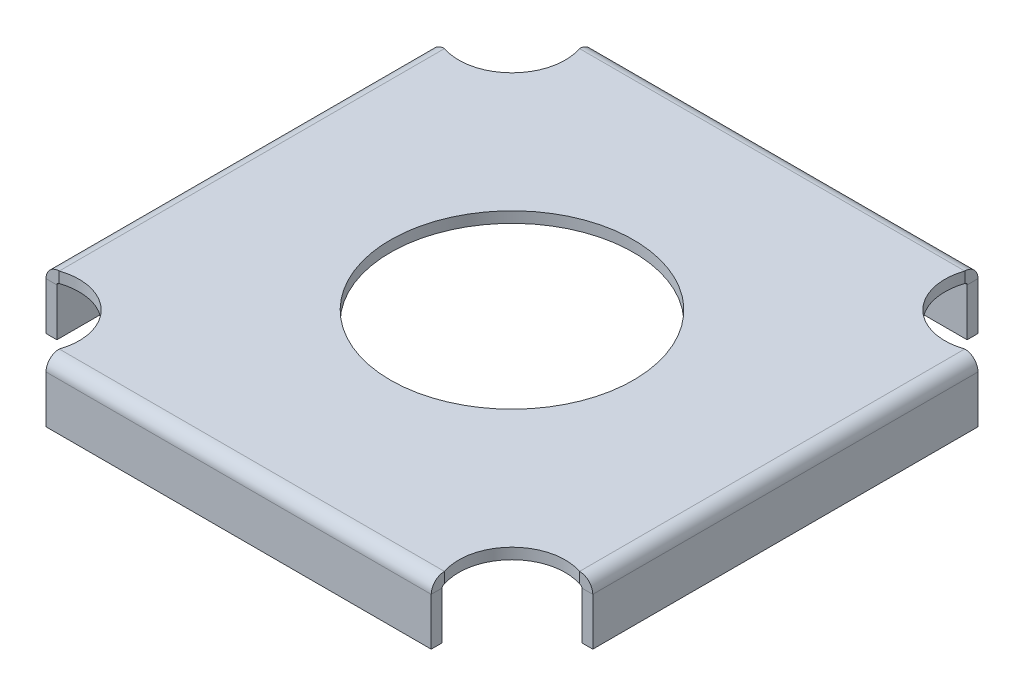
ISO-10303-21;
HEADER;
FILE_DESCRIPTION(('STEP AP214'),'2;1');
FILE_NAME('part.step','',(''),(''),'','','');
FILE_SCHEMA(('AUTOMOTIVE_DESIGN { 1 0 10303 214 1 1 1 1 }'));
ENDSEC;
DATA;
#1=APPLICATION_CONTEXT('core data for automotive mechanical design processes');
#2=APPLICATION_PROTOCOL_DEFINITION('international standard','automotive_design',2000,#1);
#3=PRODUCT_CONTEXT('',#1,'mechanical');
#4=PRODUCT('Part','Part','',(#3));
#5=PRODUCT_RELATED_PRODUCT_CATEGORY('part','',(#4));
#6=PRODUCT_DEFINITION_FORMATION('','',#4);
#7=PRODUCT_DEFINITION_CONTEXT('part definition',#1,'design');
#8=PRODUCT_DEFINITION('design','',#6,#7);
#9=PRODUCT_DEFINITION_SHAPE('','',#8);
#10=(LENGTH_UNIT() NAMED_UNIT(*) SI_UNIT(.MILLI.,.METRE.));
#11=(NAMED_UNIT(*) PLANE_ANGLE_UNIT() SI_UNIT($,.RADIAN.));
#12=(NAMED_UNIT(*) SI_UNIT($,.STERADIAN.) SOLID_ANGLE_UNIT());
#13=UNCERTAINTY_MEASURE_WITH_UNIT(LENGTH_MEASURE(1.E-05),#10,'distance_accuracy_value','');
#14=(GEOMETRIC_REPRESENTATION_CONTEXT(3) GLOBAL_UNCERTAINTY_ASSIGNED_CONTEXT((#13)) GLOBAL_UNIT_ASSIGNED_CONTEXT((#10,
#11,#12)) REPRESENTATION_CONTEXT('',''));
#15=CARTESIAN_POINT('',(0.,0.,0.));
#16=DIRECTION('',(0.,0.,1.));
#17=DIRECTION('',(1.,0.,0.));
#18=AXIS2_PLACEMENT_3D('',#15,#16,#17);
#19=CARTESIAN_POINT('',(76.2,-3.4163,76.2));
#20=DIRECTION('',(0.,1.,0.));
#21=DIRECTION('',(0.,0.,1.));
#22=AXIS2_PLACEMENT_3D('',#19,#20,#21);
#23=CYLINDRICAL_SURFACE('',#22,16.7005);
#24=CARTESIAN_POINT('',(76.2,0.,76.2));
#25=DIRECTION('',(0.,-1.,0.));
#26=DIRECTION('',(0.,0.,1.));
#27=AXIS2_PLACEMENT_3D('',#24,#25,#26);
#28=CIRCLE('',#27,16.7005);
#29=CARTESIAN_POINT('',(60.3828089759907,0.,81.5594));
#30=VERTEX_POINT('',#29);
#31=CARTESIAN_POINT('',(81.5594,0.,60.3828089759907));
#32=VERTEX_POINT('',#31);
#33=EDGE_CURVE('E462',#30,#32,#28,.T.);
#34=ORIENTED_EDGE('',*,*,#33,.F.);
#35=DIRECTION('',(0.,1.,0.));
#36=VECTOR('',#35,1.);
#37=CARTESIAN_POINT('',(60.3828089759907,-3.4163,81.5594));
#38=LINE('',#37,#36);
#39=CARTESIAN_POINT('',(60.3828089759907,-3.41629999999999,81.5594));
#40=VERTEX_POINT('',#39);
#41=EDGE_CURVE('E13',#40,#30,#38,.T.);
#42=ORIENTED_EDGE('',*,*,#41,.F.);
#43=CARTESIAN_POINT('',(76.2,-3.4163,76.2));
#44=DIRECTION('',(0.,-1.,0.));
#45=DIRECTION('',(0.,0.,1.));
#46=AXIS2_PLACEMENT_3D('',#43,#44,#45);
#47=CIRCLE('',#46,16.7005);
#48=CARTESIAN_POINT('',(81.5594,-3.4163,60.3828089759907));
#49=VERTEX_POINT('',#48);
#50=EDGE_CURVE('E465',#40,#49,#47,.T.);
#51=ORIENTED_EDGE('',*,*,#50,.T.);
#52=DIRECTION('',(0.,1.,0.));
#53=VECTOR('',#52,1.);
#54=CARTESIAN_POINT('',(81.5594,-3.4163,60.3828089759907));
#55=LINE('',#54,#53);
#56=EDGE_CURVE('E119',#49,#32,#55,.T.);
#57=ORIENTED_EDGE('',*,*,#56,.T.);
#58=EDGE_LOOP('',(#34,#42,#51,#57));
#59=FACE_BOUND('',#58,.T.);
#60=ADVANCED_FACE('F116',(#59),#23,.F.);
#61=CARTESIAN_POINT('',(-76.2,-3.4163,76.2));
#62=DIRECTION('',(0.,1.,0.));
#63=DIRECTION('',(0.,0.,1.));
#64=AXIS2_PLACEMENT_3D('',#61,#62,#63);
#65=CYLINDRICAL_SURFACE('',#64,16.7005);
#66=CARTESIAN_POINT('',(-76.2,0.,76.2));
#67=DIRECTION('',(0.,-1.,0.));
#68=DIRECTION('',(0.,0.,1.));
#69=AXIS2_PLACEMENT_3D('',#66,#67,#68);
#70=CIRCLE('',#69,16.7005);
#71=CARTESIAN_POINT('',(-81.5594,0.,60.3828089759907));
#72=VERTEX_POINT('',#71);
#73=CARTESIAN_POINT('',(-60.3828089759907,0.,81.5594));
#74=VERTEX_POINT('',#73);
#75=EDGE_CURVE('E503',#72,#74,#70,.T.);
#76=ORIENTED_EDGE('',*,*,#75,.F.);
#77=DIRECTION('',(0.,1.,0.));
#78=VECTOR('',#77,1.);
#79=CARTESIAN_POINT('',(-81.5594,-3.4163,60.3828089759907));
#80=LINE('',#79,#78);
#81=CARTESIAN_POINT('',(-81.5594,-3.4163,60.3828089759907));
#82=VERTEX_POINT('',#81);
#83=EDGE_CURVE('E510',#82,#72,#80,.T.);
#84=ORIENTED_EDGE('',*,*,#83,.F.);
#85=CARTESIAN_POINT('',(-76.2,-3.4163,76.2));
#86=DIRECTION('',(0.,-1.,0.));
#87=DIRECTION('',(0.,0.,1.));
#88=AXIS2_PLACEMENT_3D('',#85,#86,#87);
#89=CIRCLE('',#88,16.7005);
#90=CARTESIAN_POINT('',(-60.3828089759907,-3.41629999999999,81.5594));
#91=VERTEX_POINT('',#90);
#92=EDGE_CURVE('E481',#82,#91,#89,.T.);
#93=ORIENTED_EDGE('',*,*,#92,.T.);
#94=DIRECTION('',(0.,1.,0.));
#95=VECTOR('',#94,1.);
#96=CARTESIAN_POINT('',(-60.3828089759907,-3.4163,81.5594));
#97=LINE('',#96,#95);
#98=EDGE_CURVE('E124',#91,#74,#97,.T.);
#99=ORIENTED_EDGE('',*,*,#98,.T.);
#100=EDGE_LOOP('',(#76,#84,#93,#99));
#101=FACE_BOUND('',#100,.T.);
#102=ADVANCED_FACE('F542',(#101),#65,.F.);
#103=CARTESIAN_POINT('',(-76.2,-3.4163,-76.2));
#104=DIRECTION('',(0.,1.,0.));
#105=DIRECTION('',(0.,0.,1.));
#106=AXIS2_PLACEMENT_3D('',#103,#104,#105);
#107=CYLINDRICAL_SURFACE('',#106,16.7005);
#108=CARTESIAN_POINT('',(-76.2,0.,-76.2));
#109=DIRECTION('',(0.,-1.,0.));
#110=DIRECTION('',(0.,0.,1.));
#111=AXIS2_PLACEMENT_3D('',#108,#109,#110);
#112=CIRCLE('',#111,16.7005);
#113=CARTESIAN_POINT('',(-60.3828089759907,0.,-81.5594));
#114=VERTEX_POINT('',#113);
#115=CARTESIAN_POINT('',(-81.5594,0.,-60.3828089759907));
#116=VERTEX_POINT('',#115);
#117=EDGE_CURVE('E497',#114,#116,#112,.T.);
#118=ORIENTED_EDGE('',*,*,#117,.F.);
#119=DIRECTION('',(0.,1.,0.));
#120=VECTOR('',#119,1.);
#121=CARTESIAN_POINT('',(-60.3828089759907,-3.4163,-81.5594));
#122=LINE('',#121,#120);
#123=CARTESIAN_POINT('',(-60.3828089759907,-3.4163,-81.5594));
#124=VERTEX_POINT('',#123);
#125=EDGE_CURVE('E515',#124,#114,#122,.T.);
#126=ORIENTED_EDGE('',*,*,#125,.F.);
#127=CARTESIAN_POINT('',(-76.2,-3.4163,-76.2));
#128=DIRECTION('',(0.,-1.,0.));
#129=DIRECTION('',(0.,0.,1.));
#130=AXIS2_PLACEMENT_3D('',#127,#128,#129);
#131=CIRCLE('',#130,16.7005);
#132=CARTESIAN_POINT('',(-81.5594,-3.4163,-60.3828089759907));
#133=VERTEX_POINT('',#132);
#134=EDGE_CURVE('E476',#124,#133,#131,.T.);
#135=ORIENTED_EDGE('',*,*,#134,.T.);
#136=DIRECTION('',(0.,1.,0.));
#137=VECTOR('',#136,1.);
#138=CARTESIAN_POINT('',(-81.5594,-3.4163,-60.3828089759907));
#139=LINE('',#138,#137);
#140=EDGE_CURVE('E512',#133,#116,#139,.T.);
#141=ORIENTED_EDGE('',*,*,#140,.T.);
#142=EDGE_LOOP('',(#118,#126,#135,#141));
#143=FACE_BOUND('',#142,.T.);
#144=ADVANCED_FACE('F587',(#143),#107,.F.);
#145=CARTESIAN_POINT('',(76.2,-3.4163,-76.2));
#146=DIRECTION('',(0.,1.,0.));
#147=DIRECTION('',(0.,0.,1.));
#148=AXIS2_PLACEMENT_3D('',#145,#146,#147);
#149=CYLINDRICAL_SURFACE('',#148,16.7005);
#150=CARTESIAN_POINT('',(76.2,0.,-76.2));
#151=DIRECTION('',(0.,-1.,0.));
#152=DIRECTION('',(0.,0.,1.));
#153=AXIS2_PLACEMENT_3D('',#150,#151,#152);
#154=CIRCLE('',#153,16.7005);
#155=CARTESIAN_POINT('',(81.5594,0.,-60.3828089759907));
#156=VERTEX_POINT('',#155);
#157=CARTESIAN_POINT('',(60.3828089759907,0.,-81.5594));
#158=VERTEX_POINT('',#157);
#159=EDGE_CURVE('E491',#156,#158,#154,.T.);
#160=ORIENTED_EDGE('',*,*,#159,.F.);
#161=DIRECTION('',(0.,1.,0.));
#162=VECTOR('',#161,1.);
#163=CARTESIAN_POINT('',(81.5594,-3.4163,-60.3828089759907));
#164=LINE('',#163,#162);
#165=CARTESIAN_POINT('',(81.5594,-3.4163,-60.3828089759907));
#166=VERTEX_POINT('',#165);
#167=EDGE_CURVE('E520',#166,#156,#164,.T.);
#168=ORIENTED_EDGE('',*,*,#167,.F.);
#169=CARTESIAN_POINT('',(76.2,-3.4163,-76.2));
#170=DIRECTION('',(0.,-1.,0.));
#171=DIRECTION('',(0.,0.,1.));
#172=AXIS2_PLACEMENT_3D('',#169,#170,#171);
#173=CIRCLE('',#172,16.7005);
#174=CARTESIAN_POINT('',(60.3828089759907,-3.4163,-81.5594));
#175=VERTEX_POINT('',#174);
#176=EDGE_CURVE('E471',#166,#175,#173,.T.);
#177=ORIENTED_EDGE('',*,*,#176,.T.);
#178=DIRECTION('',(0.,1.,0.));
#179=VECTOR('',#178,1.);
#180=CARTESIAN_POINT('',(60.3828089759907,-3.4163,-81.5594));
#181=LINE('',#180,#179);
#182=EDGE_CURVE('E518',#175,#158,#181,.T.);
#183=ORIENTED_EDGE('',*,*,#182,.T.);
#184=EDGE_LOOP('',(#160,#168,#177,#183));
#185=FACE_BOUND('',#184,.T.);
#186=ADVANCED_FACE('F592',(#185),#149,.F.);
#187=CARTESIAN_POINT('',(76.2,-3.4163,76.2));
#188=DIRECTION('',(0.,1.,0.));
#189=DIRECTION('',(0.,0.,1.));
#190=AXIS2_PLACEMENT_3D('',#187,#188,#189);
#191=PLANE('',#190);
#192=CARTESIAN_POINT('',(0.,-3.4163,0.));
#193=DIRECTION('',(0.,1.,0.));
#194=DIRECTION('',(0.,0.,1.));
#195=AXIS2_PLACEMENT_3D('',#192,#193,#194);
#196=CIRCLE('',#195,38.1);
#197=CARTESIAN_POINT('',(0.,-3.4163,38.1));
#198=VERTEX_POINT('',#197);
#199=EDGE_CURVE('E459',#198,#198,#196,.T.);
#200=ORIENTED_EDGE('',*,*,#199,.T.);
#201=EDGE_LOOP('',(#200));
#202=FACE_BOUND('',#201,.T.);
#203=ORIENTED_EDGE('',*,*,#50,.F.);
#204=DIRECTION('',(1.,0.,0.));
#205=VECTOR('',#204,1.);
#206=CARTESIAN_POINT('',(60.3828089759907,-3.4163,81.5594));
#207=LINE('',#206,#205);
#208=EDGE_CURVE('E484',#91,#40,#207,.T.);
#209=ORIENTED_EDGE('',*,*,#208,.F.);
#210=ORIENTED_EDGE('',*,*,#92,.F.);
#211=DIRECTION('',(0.,0.,1.));
#212=VECTOR('',#211,1.);
#213=CARTESIAN_POINT('',(-81.5594,-3.4163,60.3828089759907));
#214=LINE('',#213,#212);
#215=EDGE_CURVE('E479',#133,#82,#214,.T.);
#216=ORIENTED_EDGE('',*,*,#215,.F.);
#217=ORIENTED_EDGE('',*,*,#134,.F.);
#218=DIRECTION('',(-1.,0.,0.));
#219=VECTOR('',#218,1.);
#220=CARTESIAN_POINT('',(-60.3828089759907,-3.4163,-81.5594));
#221=LINE('',#220,#219);
#222=EDGE_CURVE('E474',#175,#124,#221,.T.);
#223=ORIENTED_EDGE('',*,*,#222,.F.);
#224=ORIENTED_EDGE('',*,*,#176,.F.);
#225=DIRECTION('',(0.,0.,-1.));
#226=VECTOR('',#225,1.);
#227=CARTESIAN_POINT('',(81.5594,-3.4163,-60.3828089759907));
#228=LINE('',#227,#226);
#229=EDGE_CURVE('E468',#49,#166,#228,.T.);
#230=ORIENTED_EDGE('',*,*,#229,.F.);
#231=EDGE_LOOP('',(#203,#209,#210,#216,#217,#223,#224,#230));
#232=FACE_BOUND('',#231,.T.);
#233=ADVANCED_FACE('F548',(#202,#232),#191,.F.);
#234=CARTESIAN_POINT('',(76.2,0.,76.2));
#235=DIRECTION('',(0.,1.,0.));
#236=DIRECTION('',(0.,0.,1.));
#237=AXIS2_PLACEMENT_3D('',#234,#235,#236);
#238=PLANE('',#237);
#239=CARTESIAN_POINT('',(0.,0.,0.));
#240=DIRECTION('',(0.,1.,0.));
#241=DIRECTION('',(0.,0.,1.));
#242=AXIS2_PLACEMENT_3D('',#239,#240,#241);
#243=CIRCLE('',#242,38.1);
#244=CARTESIAN_POINT('',(0.,0.,38.1));
#245=VERTEX_POINT('',#244);
#246=EDGE_CURVE('E450',#245,#245,#243,.T.);
#247=ORIENTED_EDGE('',*,*,#246,.F.);
#248=EDGE_LOOP('',(#247));
#249=FACE_BOUND('',#248,.T.);
#250=ORIENTED_EDGE('',*,*,#33,.T.);
#251=DIRECTION('',(0.,0.,-1.));
#252=VECTOR('',#251,1.);
#253=CARTESIAN_POINT('',(81.5594,0.,-60.3828089759907));
#254=LINE('',#253,#252);
#255=EDGE_CURVE('E488',#32,#156,#254,.T.);
#256=ORIENTED_EDGE('',*,*,#255,.T.);
#257=ORIENTED_EDGE('',*,*,#159,.T.);
#258=DIRECTION('',(-1.,0.,0.));
#259=VECTOR('',#258,1.);
#260=CARTESIAN_POINT('',(-60.3828089759907,0.,-81.5594));
#261=LINE('',#260,#259);
#262=EDGE_CURVE('E494',#158,#114,#261,.T.);
#263=ORIENTED_EDGE('',*,*,#262,.T.);
#264=ORIENTED_EDGE('',*,*,#117,.T.);
#265=DIRECTION('',(0.,0.,1.));
#266=VECTOR('',#265,1.);
#267=CARTESIAN_POINT('',(-81.5594,0.,60.3828089759907));
#268=LINE('',#267,#266);
#269=EDGE_CURVE('E500',#116,#72,#268,.T.);
#270=ORIENTED_EDGE('',*,*,#269,.T.);
#271=ORIENTED_EDGE('',*,*,#75,.T.);
#272=DIRECTION('',(1.,0.,0.));
#273=VECTOR('',#272,1.);
#274=CARTESIAN_POINT('',(60.3828089759907,0.,81.5594));
#275=LINE('',#274,#273);
#276=EDGE_CURVE('E469',#74,#30,#275,.T.);
#277=ORIENTED_EDGE('',*,*,#276,.T.);
#278=EDGE_LOOP('',(#250,#256,#257,#263,#264,#270,#271,#277));
#279=FACE_BOUND('',#278,.T.);
#280=ADVANCED_FACE('F534',(#249,#279),#238,.T.);
#281=CARTESIAN_POINT('',(0.,-3.4163,0.));
#282=DIRECTION('',(0.,1.,0.));
#283=DIRECTION('',(0.,0.,1.));
#284=AXIS2_PLACEMENT_3D('',#281,#282,#283);
#285=CYLINDRICAL_SURFACE('',#284,38.1);
#286=ORIENTED_EDGE('',*,*,#199,.F.);
#287=EDGE_LOOP('',(#286));
#288=FACE_BOUND('',#287,.T.);
#289=ORIENTED_EDGE('',*,*,#246,.T.);
#290=EDGE_LOOP('',(#289));
#291=FACE_BOUND('',#290,.T.);
#292=ADVANCED_FACE('F706',(#288,#291),#285,.F.);
#293=CARTESIAN_POINT('',(60.3828089759907,-4.15289999999999,81.5594));
#294=DIRECTION('',(1.,0.,0.));
#295=DIRECTION('',(0.,0.,-1.));
#296=AXIS2_PLACEMENT_3D('',#293,#294,#295);
#297=PLANE('',#296);
#298=DIRECTION('',(0.,0.,1.));
#299=VECTOR('',#298,1.);
#300=CARTESIAN_POINT('',(60.3828089759907,-4.1529,85.7123));
#301=LINE('',#300,#299);
#302=CARTESIAN_POINT('',(60.3828089759907,-4.15289999999999,82.296));
#303=VERTEX_POINT('',#302);
#304=CARTESIAN_POINT('',(60.3828089759907,-4.15289999999998,85.7123));
#305=VERTEX_POINT('',#304);
#306=EDGE_CURVE('E408',#303,#305,#301,.T.);
#307=ORIENTED_EDGE('',*,*,#306,.F.);
#308=CARTESIAN_POINT('',(60.3828089759907,-4.15289999999999,81.5594));
#309=DIRECTION('',(-1.,0.,0.));
#310=DIRECTION('',(0.,0.,1.));
#311=AXIS2_PLACEMENT_3D('',#308,#309,#310);
#312=CIRCLE('',#311,0.736600000000004);
#313=EDGE_CURVE('E454',#40,#303,#312,.F.);
#314=ORIENTED_EDGE('',*,*,#313,.F.);
#315=ORIENTED_EDGE('',*,*,#41,.T.);
#316=CARTESIAN_POINT('',(60.3828089759907,-4.15289999999999,81.5594));
#317=DIRECTION('',(-1.,0.,0.));
#318=DIRECTION('',(0.,0.,1.));
#319=AXIS2_PLACEMENT_3D('',#316,#317,#318);
#320=CIRCLE('',#319,4.1529);
#321=EDGE_CURVE('E132',#30,#305,#320,.F.);
#322=ORIENTED_EDGE('',*,*,#321,.T.);
#323=EDGE_LOOP('',(#307,#314,#315,#322));
#324=FACE_BOUND('',#323,.T.);
#325=ADVANCED_FACE('F555',(#324),#297,.T.);
#326=CARTESIAN_POINT('',(-60.3828089759907,-4.15289999999999,81.5594));
#327=DIRECTION('',(1.,0.,0.));
#328=DIRECTION('',(0.,0.,-1.));
#329=AXIS2_PLACEMENT_3D('',#326,#327,#328);
#330=PLANE('',#329);
#331=CARTESIAN_POINT('',(-60.3828089759907,-4.15289999999999,81.5594));
#332=DIRECTION('',(-1.,0.,0.));
#333=DIRECTION('',(0.,0.,1.));
#334=AXIS2_PLACEMENT_3D('',#331,#332,#333);
#335=CIRCLE('',#334,0.736600000000004);
#336=CARTESIAN_POINT('',(-60.3828089759907,-4.15289999999999,82.296));
#337=VERTEX_POINT('',#336);
#338=EDGE_CURVE('E419',#337,#91,#335,.T.);
#339=ORIENTED_EDGE('',*,*,#338,.F.);
#340=DIRECTION('',(0.,0.,1.));
#341=VECTOR('',#340,1.);
#342=CARTESIAN_POINT('',(-60.3828089759907,-4.15289999999999,82.296));
#343=LINE('',#342,#341);
#344=CARTESIAN_POINT('',(-60.3828089759907,-4.15289999999999,85.7123));
#345=VERTEX_POINT('',#344);
#346=EDGE_CURVE('E442',#337,#345,#343,.T.);
#347=ORIENTED_EDGE('',*,*,#346,.T.);
#348=CARTESIAN_POINT('',(-60.3828089759907,-4.15289999999999,81.5594));
#349=DIRECTION('',(-1.,0.,0.));
#350=DIRECTION('',(0.,0.,1.));
#351=AXIS2_PLACEMENT_3D('',#348,#349,#350);
#352=CIRCLE('',#351,4.1529);
#353=EDGE_CURVE('E451',#345,#74,#352,.T.);
#354=ORIENTED_EDGE('',*,*,#353,.T.);
#355=ORIENTED_EDGE('',*,*,#98,.F.);
#356=EDGE_LOOP('',(#339,#347,#354,#355));
#357=FACE_BOUND('',#356,.T.);
#358=ADVANCED_FACE('F539',(#357),#330,.F.);
#359=CARTESIAN_POINT('',(-60.3828089759907,-4.15289999999999,81.5594));
#360=DIRECTION('',(-1.,0.,0.));
#361=DIRECTION('',(0.,0.,1.));
#362=AXIS2_PLACEMENT_3D('',#359,#360,#361);
#363=CYLINDRICAL_SURFACE('',#362,4.1529);
#364=ORIENTED_EDGE('',*,*,#276,.F.);
#365=ORIENTED_EDGE('',*,*,#353,.F.);
#366=DIRECTION('',(-1.,0.,0.));
#367=VECTOR('',#366,1.);
#368=CARTESIAN_POINT('',(0.,-4.15289999999999,85.7123));
#369=LINE('',#368,#367);
#370=EDGE_CURVE('E439',#305,#345,#369,.T.);
#371=ORIENTED_EDGE('',*,*,#370,.F.);
#372=ORIENTED_EDGE('',*,*,#321,.F.);
#373=EDGE_LOOP('',(#364,#365,#371,#372));
#374=FACE_BOUND('',#373,.T.);
#375=ADVANCED_FACE('F536',(#374),#363,.T.);
#376=CARTESIAN_POINT('',(-60.3828089759907,-4.15289999999999,81.5594));
#377=DIRECTION('',(-1.,0.,0.));
#378=DIRECTION('',(0.,0.,1.));
#379=AXIS2_PLACEMENT_3D('',#376,#377,#378);
#380=CYLINDRICAL_SURFACE('',#379,0.736600000000004);
#381=ORIENTED_EDGE('',*,*,#208,.T.);
#382=ORIENTED_EDGE('',*,*,#313,.T.);
#383=DIRECTION('',(1.,0.,0.));
#384=VECTOR('',#383,1.);
#385=CARTESIAN_POINT('',(60.3828089759907,-4.1529,82.296));
#386=LINE('',#385,#384);
#387=EDGE_CURVE('E445',#303,#337,#386,.F.);
#388=ORIENTED_EDGE('',*,*,#387,.T.);
#389=ORIENTED_EDGE('',*,*,#338,.T.);
#390=EDGE_LOOP('',(#381,#382,#388,#389));
#391=FACE_BOUND('',#390,.T.);
#392=ADVANCED_FACE('F552',(#391),#380,.F.);
#393=CARTESIAN_POINT('',(-60.3828089759907,-3.41629999999999,85.7123));
#394=DIRECTION('',(-1.,0.,0.));
#395=DIRECTION('',(0.,0.,1.));
#396=AXIS2_PLACEMENT_3D('',#393,#394,#395);
#397=PLANE('',#396);
#398=DIRECTION('',(0.,1.,0.));
#399=VECTOR('',#398,1.);
#400=CARTESIAN_POINT('',(-60.3828089759907,-3.41629999999999,85.7123));
#401=LINE('',#400,#399);
#402=CARTESIAN_POINT('',(-60.3828089759907,-19.05,85.7123));
#403=VERTEX_POINT('',#402);
#404=EDGE_CURVE('E423',#403,#345,#401,.T.);
#405=ORIENTED_EDGE('',*,*,#404,.T.);
#406=ORIENTED_EDGE('',*,*,#346,.F.);
#407=DIRECTION('',(0.,-1.,0.));
#408=VECTOR('',#407,1.);
#409=CARTESIAN_POINT('',(-60.3828089759907,2.17196961742773E-13,82.296));
#410=LINE('',#409,#408);
#411=CARTESIAN_POINT('',(-60.3828089759907,-19.05,82.296));
#412=VERTEX_POINT('',#411);
#413=EDGE_CURVE('E431',#412,#337,#410,.F.);
#414=ORIENTED_EDGE('',*,*,#413,.F.);
#415=DIRECTION('',(0.,0.,-1.));
#416=VECTOR('',#415,1.);
#417=CARTESIAN_POINT('',(-60.3828089759907,-19.05,85.7123));
#418=LINE('',#417,#416);
#419=EDGE_CURVE('E417',#403,#412,#418,.T.);
#420=ORIENTED_EDGE('',*,*,#419,.F.);
#421=EDGE_LOOP('',(#405,#406,#414,#420));
#422=FACE_BOUND('',#421,.T.);
#423=ADVANCED_FACE('F572',(#422),#397,.T.);
#424=CARTESIAN_POINT('',(60.3828089759907,-19.05,85.7123));
#425=DIRECTION('',(1.,0.,0.));
#426=DIRECTION('',(0.,0.,-1.));
#427=AXIS2_PLACEMENT_3D('',#424,#425,#426);
#428=PLANE('',#427);
#429=DIRECTION('',(0.,1.,0.));
#430=VECTOR('',#429,1.);
#431=CARTESIAN_POINT('',(60.3828089759907,2.17196961742773E-13,82.296));
#432=LINE('',#431,#430);
#433=CARTESIAN_POINT('',(60.3828089759907,-19.05,82.296));
#434=VERTEX_POINT('',#433);
#435=EDGE_CURVE('E437',#303,#434,#432,.F.);
#436=ORIENTED_EDGE('',*,*,#435,.F.);
#437=ORIENTED_EDGE('',*,*,#306,.T.);
#438=DIRECTION('',(0.,-1.,0.));
#439=VECTOR('',#438,1.);
#440=CARTESIAN_POINT('',(60.3828089759907,-19.05,85.7123));
#441=LINE('',#440,#439);
#442=CARTESIAN_POINT('',(60.3828089759907,-19.05,85.7123));
#443=VERTEX_POINT('',#442);
#444=EDGE_CURVE('E429',#305,#443,#441,.T.);
#445=ORIENTED_EDGE('',*,*,#444,.T.);
#446=DIRECTION('',(0.,0.,-1.));
#447=VECTOR('',#446,1.);
#448=CARTESIAN_POINT('',(60.3828089759907,-19.05,85.7123));
#449=LINE('',#448,#447);
#450=EDGE_CURVE('E420',#443,#434,#449,.T.);
#451=ORIENTED_EDGE('',*,*,#450,.T.);
#452=EDGE_LOOP('',(#436,#437,#445,#451));
#453=FACE_BOUND('',#452,.T.);
#454=ADVANCED_FACE('F559',(#453),#428,.T.);
#455=CARTESIAN_POINT('',(0.,2.29124909440662E-13,85.7123));
#456=DIRECTION('',(0.,0.,1.));
#457=DIRECTION('',(0.,-1.,0.));
#458=AXIS2_PLACEMENT_3D('',#455,#456,#457);
#459=PLANE('',#458);
#460=ORIENTED_EDGE('',*,*,#444,.F.);
#461=ORIENTED_EDGE('',*,*,#370,.T.);
#462=ORIENTED_EDGE('',*,*,#404,.F.);
#463=DIRECTION('',(-1.,0.,0.));
#464=VECTOR('',#463,1.);
#465=CARTESIAN_POINT('',(-60.3828089759907,-19.05,85.7123));
#466=LINE('',#465,#464);
#467=EDGE_CURVE('E426',#443,#403,#466,.T.);
#468=ORIENTED_EDGE('',*,*,#467,.F.);
#469=EDGE_LOOP('',(#460,#461,#462,#468));
#470=FACE_BOUND('',#469,.T.);
#471=ADVANCED_FACE('F563',(#470),#459,.T.);
#472=CARTESIAN_POINT('',(0.,2.17196961742773E-13,82.296));
#473=DIRECTION('',(0.,0.,1.));
#474=DIRECTION('',(0.,-1.,0.));
#475=AXIS2_PLACEMENT_3D('',#472,#473,#474);
#476=PLANE('',#475);
#477=ORIENTED_EDGE('',*,*,#387,.F.);
#478=ORIENTED_EDGE('',*,*,#435,.T.);
#479=DIRECTION('',(1.,0.,0.));
#480=VECTOR('',#479,1.);
#481=CARTESIAN_POINT('',(0.,-19.05,82.296));
#482=LINE('',#481,#480);
#483=EDGE_CURVE('E434',#434,#412,#482,.F.);
#484=ORIENTED_EDGE('',*,*,#483,.T.);
#485=ORIENTED_EDGE('',*,*,#413,.T.);
#486=EDGE_LOOP('',(#477,#478,#484,#485));
#487=FACE_BOUND('',#486,.T.);
#488=ADVANCED_FACE('F570',(#487),#476,.F.);
#489=CARTESIAN_POINT('',(-60.3828089759907,-19.05,85.7123));
#490=DIRECTION('',(0.,-1.,0.));
#491=DIRECTION('',(0.,0.,-1.));
#492=AXIS2_PLACEMENT_3D('',#489,#490,#491);
#493=PLANE('',#492);
#494=ORIENTED_EDGE('',*,*,#483,.F.);
#495=ORIENTED_EDGE('',*,*,#450,.F.);
#496=ORIENTED_EDGE('',*,*,#467,.T.);
#497=ORIENTED_EDGE('',*,*,#419,.T.);
#498=EDGE_LOOP('',(#494,#495,#496,#497));
#499=FACE_BOUND('',#498,.T.);
#500=ADVANCED_FACE('F567',(#499),#493,.T.);
#501=CARTESIAN_POINT('',(81.5594,-4.1529,-60.3828089759907));
#502=DIRECTION('',(0.,0.,-1.));
#503=DIRECTION('',(-1.,0.,0.));
#504=AXIS2_PLACEMENT_3D('',#501,#502,#503);
#505=PLANE('',#504);
#506=DIRECTION('',(1.,0.,0.));
#507=VECTOR('',#506,1.);
#508=CARTESIAN_POINT('',(85.7123,-4.15289999999999,-60.3828089759907));
#509=LINE('',#508,#507);
#510=CARTESIAN_POINT('',(82.296,-4.1529,-60.3828089759907));
#511=VERTEX_POINT('',#510);
#512=CARTESIAN_POINT('',(85.7123,-4.15289999999999,-60.3828089759907));
#513=VERTEX_POINT('',#512);
#514=EDGE_CURVE('E365',#511,#513,#509,.T.);
#515=ORIENTED_EDGE('',*,*,#514,.F.);
#516=CARTESIAN_POINT('',(81.5594,-4.1529,-60.3828089759907));
#517=DIRECTION('',(0.,0.,1.));
#518=DIRECTION('',(1.,0.,0.));
#519=AXIS2_PLACEMENT_3D('',#516,#517,#518);
#520=CIRCLE('',#519,0.736600000000004);
#521=EDGE_CURVE('E412',#166,#511,#520,.F.);
#522=ORIENTED_EDGE('',*,*,#521,.F.);
#523=ORIENTED_EDGE('',*,*,#167,.T.);
#524=CARTESIAN_POINT('',(81.5594,-4.1529,-60.3828089759907));
#525=DIRECTION('',(0.,0.,1.));
#526=DIRECTION('',(1.,0.,0.));
#527=AXIS2_PLACEMENT_3D('',#524,#525,#526);
#528=CIRCLE('',#527,4.1529);
#529=EDGE_CURVE('E405',#156,#513,#528,.F.);
#530=ORIENTED_EDGE('',*,*,#529,.T.);
#531=EDGE_LOOP('',(#515,#522,#523,#530));
#532=FACE_BOUND('',#531,.T.);
#533=ADVANCED_FACE('F689',(#532),#505,.T.);
#534=CARTESIAN_POINT('',(81.5594,-4.1529,60.3828089759907));
#535=DIRECTION('',(0.,0.,-1.));
#536=DIRECTION('',(-1.,0.,0.));
#537=AXIS2_PLACEMENT_3D('',#534,#535,#536);
#538=PLANE('',#537);
#539=CARTESIAN_POINT('',(81.5594,-4.1529,60.3828089759907));
#540=DIRECTION('',(0.,0.,1.));
#541=DIRECTION('',(1.,0.,0.));
#542=AXIS2_PLACEMENT_3D('',#539,#540,#541);
#543=CIRCLE('',#542,0.736600000000004);
#544=CARTESIAN_POINT('',(82.296,-4.1529,60.3828089759907));
#545=VERTEX_POINT('',#544);
#546=EDGE_CURVE('E376',#545,#49,#543,.T.);
#547=ORIENTED_EDGE('',*,*,#546,.F.);
#548=DIRECTION('',(1.,0.,0.));
#549=VECTOR('',#548,1.);
#550=CARTESIAN_POINT('',(82.296,-4.1529,60.3828089759907));
#551=LINE('',#550,#549);
#552=CARTESIAN_POINT('',(85.7123,-4.15289999999999,60.3828089759907));
#553=VERTEX_POINT('',#552);
#554=EDGE_CURVE('E398',#545,#553,#551,.T.);
#555=ORIENTED_EDGE('',*,*,#554,.T.);
#556=CARTESIAN_POINT('',(81.5594,-4.1529,60.3828089759907));
#557=DIRECTION('',(0.,0.,1.));
#558=DIRECTION('',(1.,0.,0.));
#559=AXIS2_PLACEMENT_3D('',#556,#557,#558);
#560=CIRCLE('',#559,4.1529);
#561=EDGE_CURVE('E409',#553,#32,#560,.T.);
#562=ORIENTED_EDGE('',*,*,#561,.T.);
#563=ORIENTED_EDGE('',*,*,#56,.F.);
#564=EDGE_LOOP('',(#547,#555,#562,#563));
#565=FACE_BOUND('',#564,.T.);
#566=ADVANCED_FACE('F684',(#565),#538,.F.);
#567=CARTESIAN_POINT('',(81.5594,-4.1529,60.3828089759907));
#568=DIRECTION('',(0.,0.,1.));
#569=DIRECTION('',(1.,0.,0.));
#570=AXIS2_PLACEMENT_3D('',#567,#568,#569);
#571=CYLINDRICAL_SURFACE('',#570,4.1529);
#572=ORIENTED_EDGE('',*,*,#255,.F.);
#573=ORIENTED_EDGE('',*,*,#561,.F.);
#574=DIRECTION('',(0.,0.,1.));
#575=VECTOR('',#574,1.);
#576=CARTESIAN_POINT('',(85.7123,-4.15289999999999,-60.3828089759907));
#577=LINE('',#576,#575);
#578=EDGE_CURVE('E396',#553,#513,#577,.F.);
#579=ORIENTED_EDGE('',*,*,#578,.T.);
#580=ORIENTED_EDGE('',*,*,#529,.F.);
#581=EDGE_LOOP('',(#572,#573,#579,#580));
#582=FACE_BOUND('',#581,.T.);
#583=ADVANCED_FACE('F681',(#582),#571,.T.);
#584=CARTESIAN_POINT('',(81.5594,-4.1529,60.3828089759907));
#585=DIRECTION('',(0.,0.,1.));
#586=DIRECTION('',(1.,0.,0.));
#587=AXIS2_PLACEMENT_3D('',#584,#585,#586);
#588=CYLINDRICAL_SURFACE('',#587,0.736600000000004);
#589=ORIENTED_EDGE('',*,*,#229,.T.);
#590=ORIENTED_EDGE('',*,*,#521,.T.);
#591=DIRECTION('',(0.,0.,1.));
#592=VECTOR('',#591,1.);
#593=CARTESIAN_POINT('',(82.296,-4.1529,-60.3828089759907));
#594=LINE('',#593,#592);
#595=EDGE_CURVE('E401',#511,#545,#594,.T.);
#596=ORIENTED_EDGE('',*,*,#595,.T.);
#597=ORIENTED_EDGE('',*,*,#546,.T.);
#598=EDGE_LOOP('',(#589,#590,#596,#597));
#599=FACE_BOUND('',#598,.T.);
#600=ADVANCED_FACE('F679',(#599),#588,.F.);
#601=CARTESIAN_POINT('',(85.7123,-3.41629999999999,-60.3828089759907));
#602=DIRECTION('',(0.,0.,-1.));
#603=DIRECTION('',(-1.,0.,0.));
#604=AXIS2_PLACEMENT_3D('',#601,#602,#603);
#605=PLANE('',#604);
#606=DIRECTION('',(0.,-1.,0.));
#607=VECTOR('',#606,1.);
#608=CARTESIAN_POINT('',(82.296,2.89595948990363E-13,-60.3828089759907));
#609=LINE('',#608,#607);
#610=CARTESIAN_POINT('',(82.2960000000001,-19.05,-60.3828089759907));
#611=VERTEX_POINT('',#610);
#612=EDGE_CURVE('E394',#511,#611,#609,.T.);
#613=ORIENTED_EDGE('',*,*,#612,.F.);
#614=ORIENTED_EDGE('',*,*,#514,.T.);
#615=DIRECTION('',(0.,1.,0.));
#616=VECTOR('',#615,1.);
#617=CARTESIAN_POINT('',(85.7123,-3.41629999999999,-60.3828089759907));
#618=LINE('',#617,#616);
#619=CARTESIAN_POINT('',(85.7123000000001,-19.05,-60.3828089759907));
#620=VERTEX_POINT('',#619);
#621=EDGE_CURVE('E386',#513,#620,#618,.F.);
#622=ORIENTED_EDGE('',*,*,#621,.T.);
#623=DIRECTION('',(-1.,0.,0.));
#624=VECTOR('',#623,1.);
#625=CARTESIAN_POINT('',(85.7123000000001,-19.05,-60.3828089759907));
#626=LINE('',#625,#624);
#627=EDGE_CURVE('E377',#620,#611,#626,.T.);
#628=ORIENTED_EDGE('',*,*,#627,.T.);
#629=EDGE_LOOP('',(#613,#614,#622,#628));
#630=FACE_BOUND('',#629,.T.);
#631=ADVANCED_FACE('F672',(#630),#605,.T.);
#632=CARTESIAN_POINT('',(85.7123000000001,-19.05,60.3828089759907));
#633=DIRECTION('',(0.,0.,1.));
#634=DIRECTION('',(0.,-1.,0.));
#635=AXIS2_PLACEMENT_3D('',#632,#633,#634);
#636=PLANE('',#635);
#637=DIRECTION('',(0.,-1.,0.));
#638=VECTOR('',#637,1.);
#639=CARTESIAN_POINT('',(85.7123000000001,-19.05,60.3828089759907));
#640=LINE('',#639,#638);
#641=CARTESIAN_POINT('',(85.7123000000001,-19.05,60.3828089759907));
#642=VERTEX_POINT('',#641);
#643=EDGE_CURVE('E380',#642,#553,#640,.F.);
#644=ORIENTED_EDGE('',*,*,#643,.T.);
#645=ORIENTED_EDGE('',*,*,#554,.F.);
#646=DIRECTION('',(0.,1.,0.));
#647=VECTOR('',#646,1.);
#648=CARTESIAN_POINT('',(82.296,3.16396380436809E-13,60.3828089759907));
#649=LINE('',#648,#647);
#650=CARTESIAN_POINT('',(82.2960000000001,-19.05,60.3828089759907));
#651=VERTEX_POINT('',#650);
#652=EDGE_CURVE('E388',#651,#545,#649,.T.);
#653=ORIENTED_EDGE('',*,*,#652,.F.);
#654=DIRECTION('',(-1.,0.,0.));
#655=VECTOR('',#654,1.);
#656=CARTESIAN_POINT('',(85.7123000000001,-19.05,60.3828089759907));
#657=LINE('',#656,#655);
#658=EDGE_CURVE('E374',#642,#651,#657,.T.);
#659=ORIENTED_EDGE('',*,*,#658,.F.);
#660=EDGE_LOOP('',(#644,#645,#653,#659));
#661=FACE_BOUND('',#660,.T.);
#662=ADVANCED_FACE('F665',(#661),#636,.T.);
#663=CARTESIAN_POINT('',(85.7123,3.01523896688253E-13,0.));
#664=DIRECTION('',(-1.,0.,0.));
#665=DIRECTION('',(0.,-1.,0.));
#666=AXIS2_PLACEMENT_3D('',#663,#664,#665);
#667=PLANE('',#666);
#668=ORIENTED_EDGE('',*,*,#578,.F.);
#669=ORIENTED_EDGE('',*,*,#643,.F.);
#670=DIRECTION('',(0.,0.,-1.));
#671=VECTOR('',#670,1.);
#672=CARTESIAN_POINT('',(85.7123000000001,-19.05,-60.3828089759907));
#673=LINE('',#672,#671);
#674=EDGE_CURVE('E383',#620,#642,#673,.F.);
#675=ORIENTED_EDGE('',*,*,#674,.F.);
#676=ORIENTED_EDGE('',*,*,#621,.F.);
#677=EDGE_LOOP('',(#668,#669,#675,#676));
#678=FACE_BOUND('',#677,.T.);
#679=ADVANCED_FACE('F661',(#678),#667,.F.);
#680=CARTESIAN_POINT('',(82.296,2.89595948990363E-13,0.));
#681=DIRECTION('',(-1.,0.,0.));
#682=DIRECTION('',(0.,-1.,0.));
#683=AXIS2_PLACEMENT_3D('',#680,#681,#682);
#684=PLANE('',#683);
#685=ORIENTED_EDGE('',*,*,#652,.T.);
#686=ORIENTED_EDGE('',*,*,#595,.F.);
#687=ORIENTED_EDGE('',*,*,#612,.T.);
#688=DIRECTION('',(0.,0.,1.));
#689=VECTOR('',#688,1.);
#690=CARTESIAN_POINT('',(82.2960000000001,-19.05,0.));
#691=LINE('',#690,#689);
#692=EDGE_CURVE('E391',#611,#651,#691,.T.);
#693=ORIENTED_EDGE('',*,*,#692,.T.);
#694=EDGE_LOOP('',(#685,#686,#687,#693));
#695=FACE_BOUND('',#694,.T.);
#696=ADVANCED_FACE('F664',(#695),#684,.T.);
#697=CARTESIAN_POINT('',(85.7123000000001,-19.05,-60.3828089759907));
#698=DIRECTION('',(0.,-1.,0.));
#699=DIRECTION('',(1.,0.,0.));
#700=AXIS2_PLACEMENT_3D('',#697,#698,#699);
#701=PLANE('',#700);
#702=ORIENTED_EDGE('',*,*,#692,.F.);
#703=ORIENTED_EDGE('',*,*,#627,.F.);
#704=ORIENTED_EDGE('',*,*,#674,.T.);
#705=ORIENTED_EDGE('',*,*,#658,.T.);
#706=EDGE_LOOP('',(#702,#703,#704,#705));
#707=FACE_BOUND('',#706,.T.);
#708=ADVANCED_FACE('F658',(#707),#701,.T.);
#709=CARTESIAN_POINT('',(-60.3828089759907,-4.1529,-81.5594));
#710=DIRECTION('',(-1.,0.,0.));
#711=DIRECTION('',(0.,0.,1.));
#712=AXIS2_PLACEMENT_3D('',#709,#710,#711);
#713=PLANE('',#712);
#714=DIRECTION('',(0.,0.,-1.));
#715=VECTOR('',#714,1.);
#716=CARTESIAN_POINT('',(-60.3828089759907,-4.15289999999998,-85.7123));
#717=LINE('',#716,#715);
#718=CARTESIAN_POINT('',(-60.3828089759907,-4.1529,-82.296));
#719=VERTEX_POINT('',#718);
#720=CARTESIAN_POINT('',(-60.3828089759907,-4.15289999999998,-85.7123));
#721=VERTEX_POINT('',#720);
#722=EDGE_CURVE('E322',#719,#721,#717,.T.);
#723=ORIENTED_EDGE('',*,*,#722,.F.);
#724=CARTESIAN_POINT('',(-60.3828089759907,-4.1529,-81.5594));
#725=DIRECTION('',(1.,0.,0.));
#726=DIRECTION('',(0.,0.,-1.));
#727=AXIS2_PLACEMENT_3D('',#724,#725,#726);
#728=CIRCLE('',#727,0.736600000000004);
#729=EDGE_CURVE('E369',#124,#719,#728,.F.);
#730=ORIENTED_EDGE('',*,*,#729,.F.);
#731=ORIENTED_EDGE('',*,*,#125,.T.);
#732=CARTESIAN_POINT('',(-60.3828089759907,-4.1529,-81.5594));
#733=DIRECTION('',(1.,0.,0.));
#734=DIRECTION('',(0.,0.,-1.));
#735=AXIS2_PLACEMENT_3D('',#732,#733,#734);
#736=CIRCLE('',#735,4.1529);
#737=EDGE_CURVE('E362',#114,#721,#736,.F.);
#738=ORIENTED_EDGE('',*,*,#737,.T.);
#739=EDGE_LOOP('',(#723,#730,#731,#738));
#740=FACE_BOUND('',#739,.T.);
#741=ADVANCED_FACE('F629',(#740),#713,.T.);
#742=CARTESIAN_POINT('',(60.3828089759907,-4.1529,-81.5594));
#743=DIRECTION('',(-1.,0.,0.));
#744=DIRECTION('',(0.,0.,1.));
#745=AXIS2_PLACEMENT_3D('',#742,#743,#744);
#746=PLANE('',#745);
#747=CARTESIAN_POINT('',(60.3828089759907,-4.1529,-81.5594));
#748=DIRECTION('',(1.,0.,0.));
#749=DIRECTION('',(0.,0.,-1.));
#750=AXIS2_PLACEMENT_3D('',#747,#748,#749);
#751=CIRCLE('',#750,0.736600000000004);
#752=CARTESIAN_POINT('',(60.3828089759907,-4.1529,-82.296));
#753=VERTEX_POINT('',#752);
#754=EDGE_CURVE('E333',#753,#175,#751,.T.);
#755=ORIENTED_EDGE('',*,*,#754,.F.);
#756=DIRECTION('',(0.,0.,-1.));
#757=VECTOR('',#756,1.);
#758=CARTESIAN_POINT('',(60.3828089759907,-4.15289999999999,-82.296));
#759=LINE('',#758,#757);
#760=CARTESIAN_POINT('',(60.3828089759907,-4.15289999999996,-85.7123));
#761=VERTEX_POINT('',#760);
#762=EDGE_CURVE('E355',#753,#761,#759,.T.);
#763=ORIENTED_EDGE('',*,*,#762,.T.);
#764=CARTESIAN_POINT('',(60.3828089759907,-4.1529,-81.5594));
#765=DIRECTION('',(1.,0.,0.));
#766=DIRECTION('',(0.,0.,-1.));
#767=AXIS2_PLACEMENT_3D('',#764,#765,#766);
#768=CIRCLE('',#767,4.1529);
#769=EDGE_CURVE('E366',#761,#158,#768,.T.);
#770=ORIENTED_EDGE('',*,*,#769,.T.);
#771=ORIENTED_EDGE('',*,*,#182,.F.);
#772=EDGE_LOOP('',(#755,#763,#770,#771));
#773=FACE_BOUND('',#772,.T.);
#774=ADVANCED_FACE('F609',(#773),#746,.F.);
#775=CARTESIAN_POINT('',(60.3828089759907,-4.1529,-81.5594));
#776=DIRECTION('',(1.,0.,0.));
#777=DIRECTION('',(0.,0.,-1.));
#778=AXIS2_PLACEMENT_3D('',#775,#776,#777);
#779=CYLINDRICAL_SURFACE('',#778,4.1529);
#780=ORIENTED_EDGE('',*,*,#262,.F.);
#781=ORIENTED_EDGE('',*,*,#769,.F.);
#782=DIRECTION('',(1.,0.,0.));
#783=VECTOR('',#782,1.);
#784=CARTESIAN_POINT('',(-60.3828089759907,-4.15289999999998,-85.7123));
#785=LINE('',#784,#783);
#786=EDGE_CURVE('E353',#761,#721,#785,.F.);
#787=ORIENTED_EDGE('',*,*,#786,.T.);
#788=ORIENTED_EDGE('',*,*,#737,.F.);
#789=EDGE_LOOP('',(#780,#781,#787,#788));
#790=FACE_BOUND('',#789,.T.);
#791=ADVANCED_FACE('F606',(#790),#779,.T.);
#792=CARTESIAN_POINT('',(60.3828089759907,-4.1529,-81.5594));
#793=DIRECTION('',(1.,0.,0.));
#794=DIRECTION('',(0.,0.,-1.));
#795=AXIS2_PLACEMENT_3D('',#792,#793,#794);
#796=CYLINDRICAL_SURFACE('',#795,0.736600000000004);
#797=ORIENTED_EDGE('',*,*,#222,.T.);
#798=ORIENTED_EDGE('',*,*,#729,.T.);
#799=DIRECTION('',(1.,0.,0.));
#800=VECTOR('',#799,1.);
#801=CARTESIAN_POINT('',(-60.3828089759907,-4.1529,-82.296));
#802=LINE('',#801,#800);
#803=EDGE_CURVE('E358',#719,#753,#802,.T.);
#804=ORIENTED_EDGE('',*,*,#803,.T.);
#805=ORIENTED_EDGE('',*,*,#754,.T.);
#806=EDGE_LOOP('',(#797,#798,#804,#805));
#807=FACE_BOUND('',#806,.T.);
#808=ADVANCED_FACE('F633',(#807),#796,.F.);
#809=CARTESIAN_POINT('',(-60.3828089759907,-3.41629999999999,-85.7123));
#810=DIRECTION('',(-1.,0.,0.));
#811=DIRECTION('',(0.,0.,1.));
#812=AXIS2_PLACEMENT_3D('',#809,#810,#811);
#813=PLANE('',#812);
#814=DIRECTION('',(0.,-1.,0.));
#815=VECTOR('',#814,1.);
#816=CARTESIAN_POINT('',(-60.3828089759907,2.89595948990363E-13,-82.296));
#817=LINE('',#816,#815);
#818=CARTESIAN_POINT('',(-60.3828089759907,-19.05,-82.296));
#819=VERTEX_POINT('',#818);
#820=EDGE_CURVE('E351',#719,#819,#817,.T.);
#821=ORIENTED_EDGE('',*,*,#820,.F.);
#822=ORIENTED_EDGE('',*,*,#722,.T.);
#823=DIRECTION('',(0.,1.,0.));
#824=VECTOR('',#823,1.);
#825=CARTESIAN_POINT('',(-60.3828089759907,-3.41629999999999,-85.7123));
#826=LINE('',#825,#824);
#827=CARTESIAN_POINT('',(-60.3828089759907,-19.05,-85.7123));
#828=VERTEX_POINT('',#827);
#829=EDGE_CURVE('E343',#721,#828,#826,.F.);
#830=ORIENTED_EDGE('',*,*,#829,.T.);
#831=DIRECTION('',(0.,0.,1.));
#832=VECTOR('',#831,1.);
#833=CARTESIAN_POINT('',(-60.3828089759907,-19.05,-85.7123));
#834=LINE('',#833,#832);
#835=EDGE_CURVE('E334',#828,#819,#834,.T.);
#836=ORIENTED_EDGE('',*,*,#835,.T.);
#837=EDGE_LOOP('',(#821,#822,#830,#836));
#838=FACE_BOUND('',#837,.T.);
#839=ADVANCED_FACE('F626',(#838),#813,.T.);
#840=CARTESIAN_POINT('',(60.3828089759907,-19.05,-85.7123));
#841=DIRECTION('',(1.,0.,0.));
#842=DIRECTION('',(0.,1.,0.));
#843=AXIS2_PLACEMENT_3D('',#840,#841,#842);
#844=PLANE('',#843);
#845=DIRECTION('',(0.,-1.,0.));
#846=VECTOR('',#845,1.);
#847=CARTESIAN_POINT('',(60.3828089759907,-19.05,-85.7123));
#848=LINE('',#847,#846);
#849=CARTESIAN_POINT('',(60.3828089759907,-19.05,-85.7123));
#850=VERTEX_POINT('',#849);
#851=EDGE_CURVE('E337',#850,#761,#848,.F.);
#852=ORIENTED_EDGE('',*,*,#851,.T.);
#853=ORIENTED_EDGE('',*,*,#762,.F.);
#854=DIRECTION('',(0.,1.,0.));
#855=VECTOR('',#854,1.);
#856=CARTESIAN_POINT('',(60.3828089759907,3.16396380436809E-13,-82.296));
#857=LINE('',#856,#855);
#858=CARTESIAN_POINT('',(60.3828089759907,-19.05,-82.296));
#859=VERTEX_POINT('',#858);
#860=EDGE_CURVE('E345',#859,#753,#857,.T.);
#861=ORIENTED_EDGE('',*,*,#860,.F.);
#862=DIRECTION('',(0.,0.,1.));
#863=VECTOR('',#862,1.);
#864=CARTESIAN_POINT('',(60.3828089759907,-19.05,-85.7123));
#865=LINE('',#864,#863);
#866=EDGE_CURVE('E331',#850,#859,#865,.T.);
#867=ORIENTED_EDGE('',*,*,#866,.F.);
#868=EDGE_LOOP('',(#852,#853,#861,#867));
#869=FACE_BOUND('',#868,.T.);
#870=ADVANCED_FACE('F619',(#869),#844,.T.);
#871=CARTESIAN_POINT('',(0.,3.01523896688253E-13,-85.7123));
#872=DIRECTION('',(0.,0.,1.));
#873=DIRECTION('',(0.,-1.,0.));
#874=AXIS2_PLACEMENT_3D('',#871,#872,#873);
#875=PLANE('',#874);
#876=ORIENTED_EDGE('',*,*,#786,.F.);
#877=ORIENTED_EDGE('',*,*,#851,.F.);
#878=DIRECTION('',(-1.,0.,0.));
#879=VECTOR('',#878,1.);
#880=CARTESIAN_POINT('',(-60.3828089759907,-19.05,-85.7123));
#881=LINE('',#880,#879);
#882=EDGE_CURVE('E340',#828,#850,#881,.F.);
#883=ORIENTED_EDGE('',*,*,#882,.F.);
#884=ORIENTED_EDGE('',*,*,#829,.F.);
#885=EDGE_LOOP('',(#876,#877,#883,#884));
#886=FACE_BOUND('',#885,.T.);
#887=ADVANCED_FACE('F617',(#886),#875,.F.);
#888=CARTESIAN_POINT('',(0.,2.89595948990363E-13,-82.296));
#889=DIRECTION('',(0.,0.,1.));
#890=DIRECTION('',(0.,-1.,0.));
#891=AXIS2_PLACEMENT_3D('',#888,#889,#890);
#892=PLANE('',#891);
#893=ORIENTED_EDGE('',*,*,#860,.T.);
#894=ORIENTED_EDGE('',*,*,#803,.F.);
#895=ORIENTED_EDGE('',*,*,#820,.T.);
#896=DIRECTION('',(1.,0.,0.));
#897=VECTOR('',#896,1.);
#898=CARTESIAN_POINT('',(0.,-19.05,-82.296));
#899=LINE('',#898,#897);
#900=EDGE_CURVE('E348',#819,#859,#899,.T.);
#901=ORIENTED_EDGE('',*,*,#900,.T.);
#902=EDGE_LOOP('',(#893,#894,#895,#901));
#903=FACE_BOUND('',#902,.T.);
#904=ADVANCED_FACE('F636',(#903),#892,.T.);
#905=CARTESIAN_POINT('',(-60.3828089759907,-19.05,-85.7123));
#906=DIRECTION('',(0.,-1.,0.));
#907=DIRECTION('',(0.,0.,-1.));
#908=AXIS2_PLACEMENT_3D('',#905,#906,#907);
#909=PLANE('',#908);
#910=ORIENTED_EDGE('',*,*,#900,.F.);
#911=ORIENTED_EDGE('',*,*,#835,.F.);
#912=ORIENTED_EDGE('',*,*,#882,.T.);
#913=ORIENTED_EDGE('',*,*,#866,.T.);
#914=EDGE_LOOP('',(#910,#911,#912,#913));
#915=FACE_BOUND('',#914,.T.);
#916=ADVANCED_FACE('F622',(#915),#909,.T.);
#917=CARTESIAN_POINT('',(-81.5594,-4.1529,60.3828089759907));
#918=DIRECTION('',(0.,0.,1.));
#919=DIRECTION('',(1.,0.,0.));
#920=AXIS2_PLACEMENT_3D('',#917,#918,#919);
#921=PLANE('',#920);
#922=DIRECTION('',(-1.,0.,0.));
#923=VECTOR('',#922,1.);
#924=CARTESIAN_POINT('',(-85.7123,-4.15289999999999,60.3828089759907));
#925=LINE('',#924,#923);
#926=CARTESIAN_POINT('',(-82.296,-4.1529,60.3828089759907));
#927=VERTEX_POINT('',#926);
#928=CARTESIAN_POINT('',(-85.7123,-4.15289999999999,60.3828089759907));
#929=VERTEX_POINT('',#928);
#930=EDGE_CURVE('E318',#927,#929,#925,.T.);
#931=ORIENTED_EDGE('',*,*,#930,.F.);
#932=CARTESIAN_POINT('',(-81.5594,-4.1529,60.3828089759907));
#933=DIRECTION('',(0.,0.,-1.));
#934=DIRECTION('',(-1.,0.,0.));
#935=AXIS2_PLACEMENT_3D('',#932,#933,#934);
#936=CIRCLE('',#935,0.736600000000004);
#937=EDGE_CURVE('E326',#82,#927,#936,.F.);
#938=ORIENTED_EDGE('',*,*,#937,.F.);
#939=ORIENTED_EDGE('',*,*,#83,.T.);
#940=CARTESIAN_POINT('',(-81.5594,-4.1529,60.3828089759907));
#941=DIRECTION('',(0.,0.,-1.));
#942=DIRECTION('',(-1.,0.,0.));
#943=AXIS2_PLACEMENT_3D('',#940,#941,#942);
#944=CIRCLE('',#943,4.1529);
#945=EDGE_CURVE('E139',#72,#929,#944,.F.);
#946=ORIENTED_EDGE('',*,*,#945,.T.);
#947=EDGE_LOOP('',(#931,#938,#939,#946));
#948=FACE_BOUND('',#947,.T.);
#949=ADVANCED_FACE('F643',(#948),#921,.T.);
#950=CARTESIAN_POINT('',(-81.5594,-4.1529,-60.3828089759907));
#951=DIRECTION('',(0.,0.,1.));
#952=DIRECTION('',(1.,0.,0.));
#953=AXIS2_PLACEMENT_3D('',#950,#951,#952);
#954=PLANE('',#953);
#955=CARTESIAN_POINT('',(-81.5594,-4.1529,-60.3828089759907));
#956=DIRECTION('',(0.,0.,-1.));
#957=DIRECTION('',(-1.,0.,0.));
#958=AXIS2_PLACEMENT_3D('',#955,#956,#957);
#959=CIRCLE('',#958,0.736600000000004);
#960=CARTESIAN_POINT('',(-82.296,-4.1529,-60.3828089759907));
#961=VERTEX_POINT('',#960);
#962=EDGE_CURVE('E288',#961,#133,#959,.T.);
#963=ORIENTED_EDGE('',*,*,#962,.F.);
#964=DIRECTION('',(-1.,0.,0.));
#965=VECTOR('',#964,1.);
#966=CARTESIAN_POINT('',(-82.296,-4.1529,-60.3828089759907));
#967=LINE('',#966,#965);
#968=CARTESIAN_POINT('',(-85.7123,-4.15289999999999,-60.3828089759907));
#969=VERTEX_POINT('',#968);
#970=EDGE_CURVE('E313',#961,#969,#967,.T.);
#971=ORIENTED_EDGE('',*,*,#970,.T.);
#972=CARTESIAN_POINT('',(-81.5594,-4.1529,-60.3828089759907));
#973=DIRECTION('',(0.,0.,-1.));
#974=DIRECTION('',(-1.,0.,0.));
#975=AXIS2_PLACEMENT_3D('',#972,#973,#974);
#976=CIRCLE('',#975,4.1529);
#977=EDGE_CURVE('E323',#969,#116,#976,.T.);
#978=ORIENTED_EDGE('',*,*,#977,.T.);
#979=ORIENTED_EDGE('',*,*,#140,.F.);
#980=EDGE_LOOP('',(#963,#971,#978,#979));
#981=FACE_BOUND('',#980,.T.);
#982=ADVANCED_FACE('F952',(#981),#954,.F.);
#983=CARTESIAN_POINT('',(-81.5594,-4.1529,-60.3828089759907));
#984=DIRECTION('',(0.,0.,-1.));
#985=DIRECTION('',(-1.,0.,0.));
#986=AXIS2_PLACEMENT_3D('',#983,#984,#985);
#987=CYLINDRICAL_SURFACE('',#986,4.1529);
#988=ORIENTED_EDGE('',*,*,#269,.F.);
#989=ORIENTED_EDGE('',*,*,#977,.F.);
#990=DIRECTION('',(0.,0.,-1.));
#991=VECTOR('',#990,1.);
#992=CARTESIAN_POINT('',(-85.7123,-4.15289999999999,60.3828089759907));
#993=LINE('',#992,#991);
#994=EDGE_CURVE('E297',#969,#929,#993,.F.);
#995=ORIENTED_EDGE('',*,*,#994,.T.);
#996=ORIENTED_EDGE('',*,*,#945,.F.);
#997=EDGE_LOOP('',(#988,#989,#995,#996));
#998=FACE_BOUND('',#997,.T.);
#999=ADVANCED_FACE('F963',(#998),#987,.T.);
#1000=CARTESIAN_POINT('',(-81.5594,-4.1529,-60.3828089759907));
#1001=DIRECTION('',(0.,0.,-1.));
#1002=DIRECTION('',(-1.,0.,0.));
#1003=AXIS2_PLACEMENT_3D('',#1000,#1001,#1002);
#1004=CYLINDRICAL_SURFACE('',#1003,0.736600000000004);
#1005=ORIENTED_EDGE('',*,*,#215,.T.);
#1006=ORIENTED_EDGE('',*,*,#937,.T.);
#1007=DIRECTION('',(0.,0.,-1.));
#1008=VECTOR('',#1007,1.);
#1009=CARTESIAN_POINT('',(-82.296,-4.1529,60.3828089759907));
#1010=LINE('',#1009,#1008);
#1011=EDGE_CURVE('E316',#927,#961,#1010,.T.);
#1012=ORIENTED_EDGE('',*,*,#1011,.T.);
#1013=ORIENTED_EDGE('',*,*,#962,.T.);
#1014=EDGE_LOOP('',(#1005,#1006,#1012,#1013));
#1015=FACE_BOUND('',#1014,.T.);
#1016=ADVANCED_FACE('F973',(#1015),#1004,.F.);
#1017=CARTESIAN_POINT('',(-85.7123,-3.41629999999999,60.3828089759907));
#1018=DIRECTION('',(0.,0.,1.));
#1019=DIRECTION('',(1.,0.,0.));
#1020=AXIS2_PLACEMENT_3D('',#1017,#1018,#1019);
#1021=PLANE('',#1020);
#1022=DIRECTION('',(0.,-1.,0.));
#1023=VECTOR('',#1022,1.);
#1024=CARTESIAN_POINT('',(-82.296,2.89595948990363E-13,60.3828089759907));
#1025=LINE('',#1024,#1023);
#1026=CARTESIAN_POINT('',(-82.296,-19.05,60.3828089759907));
#1027=VERTEX_POINT('',#1026);
#1028=EDGE_CURVE('E310',#927,#1027,#1025,.T.);
#1029=ORIENTED_EDGE('',*,*,#1028,.F.);
#1030=ORIENTED_EDGE('',*,*,#930,.T.);
#1031=DIRECTION('',(0.,1.,0.));
#1032=VECTOR('',#1031,1.);
#1033=CARTESIAN_POINT('',(-85.7123,-3.41629999999999,60.3828089759907));
#1034=LINE('',#1033,#1032);
#1035=CARTESIAN_POINT('',(-85.7123,-19.05,60.3828089759907));
#1036=VERTEX_POINT('',#1035);
#1037=EDGE_CURVE('E302',#929,#1036,#1034,.F.);
#1038=ORIENTED_EDGE('',*,*,#1037,.T.);
#1039=DIRECTION('',(1.,0.,0.));
#1040=VECTOR('',#1039,1.);
#1041=CARTESIAN_POINT('',(-85.7123,-19.05,60.3828089759907));
#1042=LINE('',#1041,#1040);
#1043=EDGE_CURVE('E289',#1036,#1027,#1042,.T.);
#1044=ORIENTED_EDGE('',*,*,#1043,.T.);
#1045=EDGE_LOOP('',(#1029,#1030,#1038,#1044));
#1046=FACE_BOUND('',#1045,.T.);
#1047=ADVANCED_FACE('F983',(#1046),#1021,.T.);
#1048=CARTESIAN_POINT('',(-85.7123,-19.05,-60.3828089759907));
#1049=DIRECTION('',(0.,0.,-1.));
#1050=DIRECTION('',(0.,1.,0.));
#1051=AXIS2_PLACEMENT_3D('',#1048,#1049,#1050);
#1052=PLANE('',#1051);
#1053=DIRECTION('',(0.,-1.,0.));
#1054=VECTOR('',#1053,1.);
#1055=CARTESIAN_POINT('',(-85.7123,-19.05,-60.3828089759907));
#1056=LINE('',#1055,#1054);
#1057=CARTESIAN_POINT('',(-85.7123,-19.05,-60.3828089759907));
#1058=VERTEX_POINT('',#1057);
#1059=EDGE_CURVE('E281',#1058,#969,#1056,.F.);
#1060=ORIENTED_EDGE('',*,*,#1059,.T.);
#1061=ORIENTED_EDGE('',*,*,#970,.F.);
#1062=DIRECTION('',(0.,1.,0.));
#1063=VECTOR('',#1062,1.);
#1064=CARTESIAN_POINT('',(-82.296,2.62795517543918E-13,-60.3828089759907));
#1065=LINE('',#1064,#1063);
#1066=CARTESIAN_POINT('',(-82.296,-19.05,-60.3828089759907));
#1067=VERTEX_POINT('',#1066);
#1068=EDGE_CURVE('E283',#1067,#961,#1065,.T.);
#1069=ORIENTED_EDGE('',*,*,#1068,.F.);
#1070=DIRECTION('',(1.,0.,0.));
#1071=VECTOR('',#1070,1.);
#1072=CARTESIAN_POINT('',(-85.7123,-19.05,-60.3828089759907));
#1073=LINE('',#1072,#1071);
#1074=EDGE_CURVE('E277',#1058,#1067,#1073,.T.);
#1075=ORIENTED_EDGE('',*,*,#1074,.F.);
#1076=EDGE_LOOP('',(#1060,#1061,#1069,#1075));
#1077=FACE_BOUND('',#1076,.T.);
#1078=ADVANCED_FACE('F279',(#1077),#1052,.T.);
#1079=CARTESIAN_POINT('',(-85.7123,3.01523896688253E-13,0.));
#1080=DIRECTION('',(1.,0.,0.));
#1081=DIRECTION('',(0.,1.,0.));
#1082=AXIS2_PLACEMENT_3D('',#1079,#1080,#1081);
#1083=PLANE('',#1082);
#1084=ORIENTED_EDGE('',*,*,#994,.F.);
#1085=ORIENTED_EDGE('',*,*,#1059,.F.);
#1086=DIRECTION('',(0.,0.,1.));
#1087=VECTOR('',#1086,1.);
#1088=CARTESIAN_POINT('',(-85.7123,-19.05,60.3828089759907));
#1089=LINE('',#1088,#1087);
#1090=EDGE_CURVE('E296',#1036,#1058,#1089,.F.);
#1091=ORIENTED_EDGE('',*,*,#1090,.F.);
#1092=ORIENTED_EDGE('',*,*,#1037,.F.);
#1093=EDGE_LOOP('',(#1084,#1085,#1091,#1092));
#1094=FACE_BOUND('',#1093,.T.);
#1095=ADVANCED_FACE('F294',(#1094),#1083,.F.);
#1096=CARTESIAN_POINT('',(-82.296,2.89595948990363E-13,0.));
#1097=DIRECTION('',(1.,0.,0.));
#1098=DIRECTION('',(0.,1.,0.));
#1099=AXIS2_PLACEMENT_3D('',#1096,#1097,#1098);
#1100=PLANE('',#1099);
#1101=ORIENTED_EDGE('',*,*,#1068,.T.);
#1102=ORIENTED_EDGE('',*,*,#1011,.F.);
#1103=ORIENTED_EDGE('',*,*,#1028,.T.);
#1104=DIRECTION('',(0.,0.,-1.));
#1105=VECTOR('',#1104,1.);
#1106=CARTESIAN_POINT('',(-82.296,-19.05,0.));
#1107=LINE('',#1106,#1105);
#1108=EDGE_CURVE('E308',#1027,#1067,#1107,.T.);
#1109=ORIENTED_EDGE('',*,*,#1108,.T.);
#1110=EDGE_LOOP('',(#1101,#1102,#1103,#1109));
#1111=FACE_BOUND('',#1110,.T.);
#1112=ADVANCED_FACE('F1013',(#1111),#1100,.T.);
#1113=CARTESIAN_POINT('',(-85.7123,-19.05,60.3828089759907));
#1114=DIRECTION('',(0.,-1.,0.));
#1115=DIRECTION('',(1.,0.,0.));
#1116=AXIS2_PLACEMENT_3D('',#1113,#1114,#1115);
#1117=PLANE('',#1116);
#1118=ORIENTED_EDGE('',*,*,#1108,.F.);
#1119=ORIENTED_EDGE('',*,*,#1043,.F.);
#1120=ORIENTED_EDGE('',*,*,#1090,.T.);
#1121=ORIENTED_EDGE('',*,*,#1074,.T.);
#1122=EDGE_LOOP('',(#1118,#1119,#1120,#1121));
#1123=FACE_BOUND('',#1122,.T.);
#1124=ADVANCED_FACE('F300',(#1123),#1117,.T.);
#1125=CLOSED_SHELL('',(#60,#102,#144,#186,#233,#280,#292,#325,#358,#375,#392,#423,#454,#471,
#488,#500,#533,#566,#583,#600,#631,#662,#679,#696,#708,#741,#774,#791,#808,#839,#870,#887,#904,
#916,#949,#982,#999,#1016,#1047,#1078,#1095,#1112,#1124));
#1126=MANIFOLD_SOLID_BREP('B2',#1125);
#1127=ADVANCED_BREP_SHAPE_REPRESENTATION('',(#18,#1126),#14);
#1128=SHAPE_DEFINITION_REPRESENTATION(#9,#1127);
ENDSEC;
END-ISO-10303-21;
